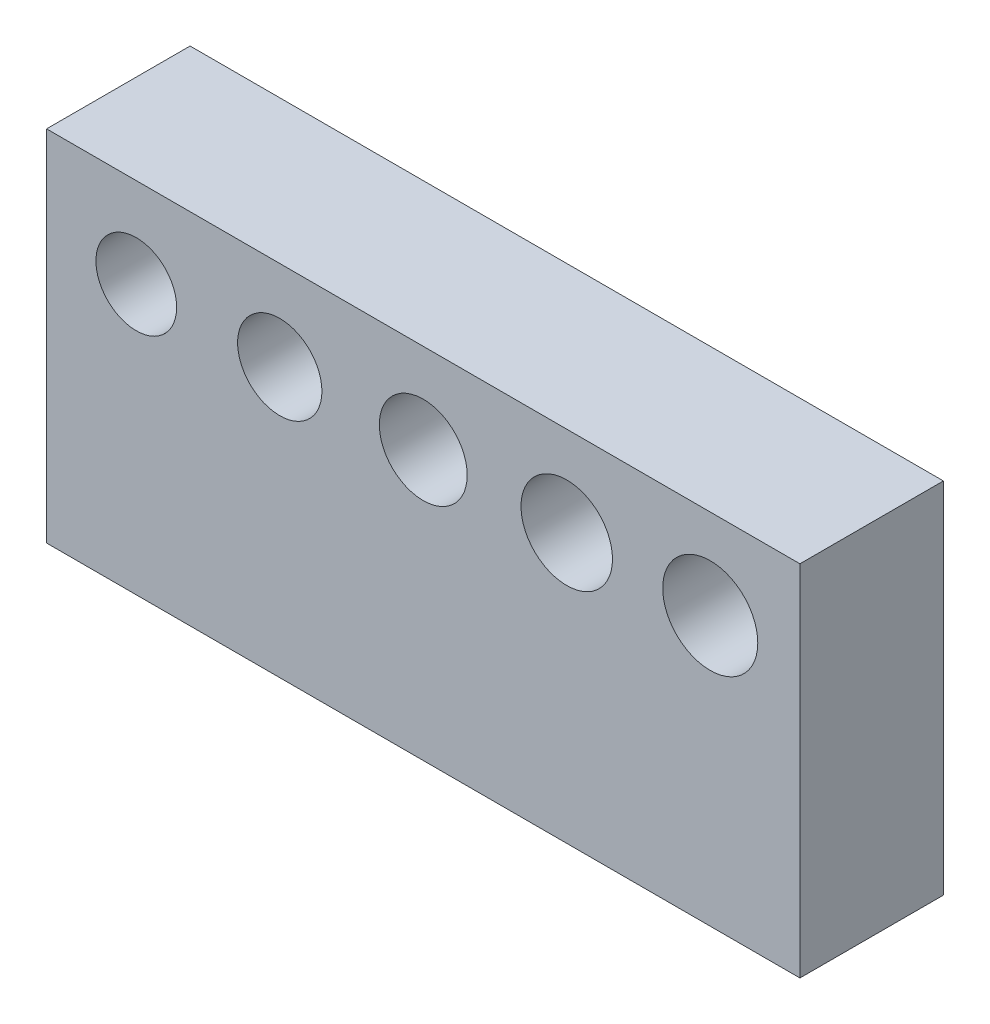
ISO-10303-21;
HEADER;
FILE_DESCRIPTION(('STEP AP214'),'2;1');
FILE_NAME('part.step','',(''),(''),'','','');
FILE_SCHEMA(('AUTOMOTIVE_DESIGN { 1 0 10303 214 1 1 1 1 }'));
ENDSEC;
DATA;
#1=APPLICATION_CONTEXT('core data for automotive mechanical design processes');
#2=APPLICATION_PROTOCOL_DEFINITION('international standard','automotive_design',2000,#1);
#3=PRODUCT_CONTEXT('',#1,'mechanical');
#4=PRODUCT('Part','Part','',(#3));
#5=PRODUCT_RELATED_PRODUCT_CATEGORY('part','',(#4));
#6=PRODUCT_DEFINITION_FORMATION('','',#4);
#7=PRODUCT_DEFINITION_CONTEXT('part definition',#1,'design');
#8=PRODUCT_DEFINITION('design','',#6,#7);
#9=PRODUCT_DEFINITION_SHAPE('','',#8);
#10=(LENGTH_UNIT() NAMED_UNIT(*) SI_UNIT(.MILLI.,.METRE.));
#11=(NAMED_UNIT(*) PLANE_ANGLE_UNIT() SI_UNIT($,.RADIAN.));
#12=(NAMED_UNIT(*) SI_UNIT($,.STERADIAN.) SOLID_ANGLE_UNIT());
#13=UNCERTAINTY_MEASURE_WITH_UNIT(LENGTH_MEASURE(1.E-05),#10,'distance_accuracy_value','');
#14=(GEOMETRIC_REPRESENTATION_CONTEXT(3) GLOBAL_UNCERTAINTY_ASSIGNED_CONTEXT((#13)) GLOBAL_UNIT_ASSIGNED_CONTEXT((#10,
#11,#12)) REPRESENTATION_CONTEXT('',''));
#15=CARTESIAN_POINT('',(0.,0.,0.));
#16=DIRECTION('',(0.,0.,1.));
#17=DIRECTION('',(1.,0.,0.));
#18=AXIS2_PLACEMENT_3D('',#15,#16,#17);
#19=CARTESIAN_POINT('',(21.,10.,8.));
#20=DIRECTION('',(-1.,0.,0.));
#21=DIRECTION('',(0.,0.,1.));
#22=AXIS2_PLACEMENT_3D('',#19,#20,#21);
#23=PLANE('',#22);
#24=DIRECTION('',(0.,1.,0.));
#25=VECTOR('',#24,1.);
#26=CARTESIAN_POINT('',(21.,10.,0.));
#27=LINE('',#26,#25);
#28=CARTESIAN_POINT('',(21.,-10.,0.));
#29=VERTEX_POINT('',#28);
#30=CARTESIAN_POINT('',(21.,10.,0.));
#31=VERTEX_POINT('',#30);
#32=EDGE_CURVE('E96',#29,#31,#27,.T.);
#33=ORIENTED_EDGE('',*,*,#32,.T.);
#34=DIRECTION('',(0.,0.,-1.));
#35=VECTOR('',#34,1.);
#36=CARTESIAN_POINT('',(21.,10.,8.));
#37=LINE('',#36,#35);
#38=CARTESIAN_POINT('',(21.,10.,8.));
#39=VERTEX_POINT('',#38);
#40=EDGE_CURVE('E11',#39,#31,#37,.T.);
#41=ORIENTED_EDGE('',*,*,#40,.F.);
#42=DIRECTION('',(0.,1.,0.));
#43=VECTOR('',#42,1.);
#44=CARTESIAN_POINT('',(21.,10.,8.));
#45=LINE('',#44,#43);
#46=CARTESIAN_POINT('',(21.,-10.,8.));
#47=VERTEX_POINT('',#46);
#48=EDGE_CURVE('E84',#47,#39,#45,.T.);
#49=ORIENTED_EDGE('',*,*,#48,.F.);
#50=DIRECTION('',(0.,0.,-1.));
#51=VECTOR('',#50,1.);
#52=CARTESIAN_POINT('',(21.,-10.,8.));
#53=LINE('',#52,#51);
#54=EDGE_CURVE('E92',#47,#29,#53,.T.);
#55=ORIENTED_EDGE('',*,*,#54,.T.);
#56=EDGE_LOOP('',(#33,#41,#49,#55));
#57=FACE_BOUND('',#56,.T.);
#58=ADVANCED_FACE('F33',(#57),#23,.F.);
#59=CARTESIAN_POINT('',(-21.,10.,8.));
#60=DIRECTION('',(0.,-1.,0.));
#61=DIRECTION('',(0.,0.,-1.));
#62=AXIS2_PLACEMENT_3D('',#59,#60,#61);
#63=PLANE('',#62);
#64=DIRECTION('',(-1.,0.,0.));
#65=VECTOR('',#64,1.);
#66=CARTESIAN_POINT('',(-21.,10.,0.));
#67=LINE('',#66,#65);
#68=CARTESIAN_POINT('',(-21.,10.,0.));
#69=VERTEX_POINT('',#68);
#70=EDGE_CURVE('E88',#31,#69,#67,.T.);
#71=ORIENTED_EDGE('',*,*,#70,.T.);
#72=DIRECTION('',(0.,0.,-1.));
#73=VECTOR('',#72,1.);
#74=CARTESIAN_POINT('',(-21.,10.,8.));
#75=LINE('',#74,#73);
#76=CARTESIAN_POINT('',(-21.,10.,8.));
#77=VERTEX_POINT('',#76);
#78=EDGE_CURVE('E41',#77,#69,#75,.T.);
#79=ORIENTED_EDGE('',*,*,#78,.F.);
#80=DIRECTION('',(-1.,0.,0.));
#81=VECTOR('',#80,1.);
#82=CARTESIAN_POINT('',(-21.,10.,8.));
#83=LINE('',#82,#81);
#84=EDGE_CURVE('E79',#39,#77,#83,.T.);
#85=ORIENTED_EDGE('',*,*,#84,.F.);
#86=ORIENTED_EDGE('',*,*,#40,.T.);
#87=EDGE_LOOP('',(#71,#79,#85,#86));
#88=FACE_BOUND('',#87,.T.);
#89=ADVANCED_FACE('F87',(#88),#63,.F.);
#90=CARTESIAN_POINT('',(-21.,10.,8.));
#91=DIRECTION('',(1.,0.,0.));
#92=DIRECTION('',(0.,0.,-1.));
#93=AXIS2_PLACEMENT_3D('',#90,#91,#92);
#94=PLANE('',#93);
#95=DIRECTION('',(0.,-1.,0.));
#96=VECTOR('',#95,1.);
#97=CARTESIAN_POINT('',(-21.,10.,0.));
#98=LINE('',#97,#96);
#99=CARTESIAN_POINT('',(-21.,-10.,0.));
#100=VERTEX_POINT('',#99);
#101=EDGE_CURVE('E66',#69,#100,#98,.T.);
#102=ORIENTED_EDGE('',*,*,#101,.T.);
#103=DIRECTION('',(0.,0.,-1.));
#104=VECTOR('',#103,1.);
#105=CARTESIAN_POINT('',(-21.,-10.,8.));
#106=LINE('',#105,#104);
#107=CARTESIAN_POINT('',(-21.,-10.,8.));
#108=VERTEX_POINT('',#107);
#109=EDGE_CURVE('E89',#108,#100,#106,.T.);
#110=ORIENTED_EDGE('',*,*,#109,.F.);
#111=DIRECTION('',(0.,-1.,0.));
#112=VECTOR('',#111,1.);
#113=CARTESIAN_POINT('',(-21.,10.,8.));
#114=LINE('',#113,#112);
#115=EDGE_CURVE('E82',#77,#108,#114,.T.);
#116=ORIENTED_EDGE('',*,*,#115,.F.);
#117=ORIENTED_EDGE('',*,*,#78,.T.);
#118=EDGE_LOOP('',(#102,#110,#116,#117));
#119=FACE_BOUND('',#118,.T.);
#120=ADVANCED_FACE('F90',(#119),#94,.F.);
#121=CARTESIAN_POINT('',(-21.,-10.,8.));
#122=DIRECTION('',(0.,1.,0.));
#123=DIRECTION('',(0.,0.,1.));
#124=AXIS2_PLACEMENT_3D('',#121,#122,#123);
#125=PLANE('',#124);
#126=CARTESIAN_POINT('',(-16.,-10.,4.));
#127=DIRECTION('',(0.,-1.,0.));
#128=DIRECTION('',(0.,0.,-1.));
#129=AXIS2_PLACEMENT_3D('',#126,#127,#128);
#130=CIRCLE('',#129,2.15);
#131=CARTESIAN_POINT('',(-16.,-10.,1.85));
#132=VERTEX_POINT('',#131);
#133=EDGE_CURVE('E158',#132,#132,#130,.T.);
#134=ORIENTED_EDGE('',*,*,#133,.F.);
#135=EDGE_LOOP('',(#134));
#136=FACE_BOUND('',#135,.T.);
#137=CARTESIAN_POINT('',(-7.99999999999999,-10.,4.));
#138=DIRECTION('',(0.,-1.,0.));
#139=DIRECTION('',(0.,0.,-1.));
#140=AXIS2_PLACEMENT_3D('',#137,#138,#139);
#141=CIRCLE('',#140,2.25);
#142=CARTESIAN_POINT('',(-7.99999999999999,-10.,1.75));
#143=VERTEX_POINT('',#142);
#144=EDGE_CURVE('E152',#143,#143,#141,.T.);
#145=ORIENTED_EDGE('',*,*,#144,.F.);
#146=EDGE_LOOP('',(#145));
#147=FACE_BOUND('',#146,.T.);
#148=CARTESIAN_POINT('',(0.,-10.,4.));
#149=DIRECTION('',(0.,-1.,0.));
#150=DIRECTION('',(0.,0.,-1.));
#151=AXIS2_PLACEMENT_3D('',#148,#149,#150);
#152=CIRCLE('',#151,2.35);
#153=CARTESIAN_POINT('',(0.,-10.,1.65));
#154=VERTEX_POINT('',#153);
#155=EDGE_CURVE('E146',#154,#154,#152,.T.);
#156=ORIENTED_EDGE('',*,*,#155,.F.);
#157=EDGE_LOOP('',(#156));
#158=FACE_BOUND('',#157,.T.);
#159=CARTESIAN_POINT('',(8.00000000000001,-10.,4.));
#160=DIRECTION('',(0.,-1.,0.));
#161=DIRECTION('',(0.,0.,-1.));
#162=AXIS2_PLACEMENT_3D('',#159,#160,#161);
#163=CIRCLE('',#162,2.45);
#164=CARTESIAN_POINT('',(8.00000000000001,-10.,1.55));
#165=VERTEX_POINT('',#164);
#166=EDGE_CURVE('E140',#165,#165,#163,.T.);
#167=ORIENTED_EDGE('',*,*,#166,.F.);
#168=EDGE_LOOP('',(#167));
#169=FACE_BOUND('',#168,.T.);
#170=DIRECTION('',(1.,0.,0.));
#171=VECTOR('',#170,1.);
#172=CARTESIAN_POINT('',(-21.,-10.,0.));
#173=LINE('',#172,#171);
#174=EDGE_CURVE('E72',#100,#29,#173,.T.);
#175=ORIENTED_EDGE('',*,*,#174,.T.);
#176=ORIENTED_EDGE('',*,*,#54,.F.);
#177=DIRECTION('',(1.,0.,0.));
#178=VECTOR('',#177,1.);
#179=CARTESIAN_POINT('',(-21.,-10.,8.));
#180=LINE('',#179,#178);
#181=EDGE_CURVE('E49',#108,#47,#180,.T.);
#182=ORIENTED_EDGE('',*,*,#181,.F.);
#183=ORIENTED_EDGE('',*,*,#109,.T.);
#184=EDGE_LOOP('',(#175,#176,#182,#183));
#185=FACE_BOUND('',#184,.T.);
#186=ADVANCED_FACE('F104',(#136,#147,#158,#169,#185),#125,.F.);
#187=CARTESIAN_POINT('',(0.,0.,8.));
#188=DIRECTION('',(0.,0.,1.));
#189=DIRECTION('',(1.,0.,0.));
#190=AXIS2_PLACEMENT_3D('',#187,#188,#189);
#191=PLANE('',#190);
#192=CARTESIAN_POINT('',(-16.,5.,8.));
#193=DIRECTION('',(0.,0.,1.));
#194=DIRECTION('',(1.,0.,0.));
#195=AXIS2_PLACEMENT_3D('',#192,#193,#194);
#196=CIRCLE('',#195,2.25);
#197=CARTESIAN_POINT('',(-13.75,5.,8.));
#198=VERTEX_POINT('',#197);
#199=EDGE_CURVE('E135',#198,#198,#196,.T.);
#200=ORIENTED_EDGE('',*,*,#199,.F.);
#201=EDGE_LOOP('',(#200));
#202=FACE_BOUND('',#201,.T.);
#203=CARTESIAN_POINT('',(-7.99999999999999,5.,8.));
#204=DIRECTION('',(0.,0.,1.));
#205=DIRECTION('',(1.,0.,0.));
#206=AXIS2_PLACEMENT_3D('',#203,#204,#205);
#207=CIRCLE('',#206,2.35);
#208=CARTESIAN_POINT('',(-5.64999999999999,5.,8.));
#209=VERTEX_POINT('',#208);
#210=EDGE_CURVE('E129',#209,#209,#207,.T.);
#211=ORIENTED_EDGE('',*,*,#210,.F.);
#212=EDGE_LOOP('',(#211));
#213=FACE_BOUND('',#212,.T.);
#214=CARTESIAN_POINT('',(0.,5.,8.));
#215=DIRECTION('',(0.,0.,1.));
#216=DIRECTION('',(1.,0.,0.));
#217=AXIS2_PLACEMENT_3D('',#214,#215,#216);
#218=CIRCLE('',#217,2.45);
#219=CARTESIAN_POINT('',(2.45000000000001,5.,8.));
#220=VERTEX_POINT('',#219);
#221=EDGE_CURVE('E123',#220,#220,#218,.T.);
#222=ORIENTED_EDGE('',*,*,#221,.F.);
#223=EDGE_LOOP('',(#222));
#224=FACE_BOUND('',#223,.T.);
#225=CARTESIAN_POINT('',(8.00000000000001,5.,8.));
#226=DIRECTION('',(0.,0.,1.));
#227=DIRECTION('',(1.,0.,0.));
#228=AXIS2_PLACEMENT_3D('',#225,#226,#227);
#229=CIRCLE('',#228,2.55);
#230=CARTESIAN_POINT('',(10.55,5.,8.));
#231=VERTEX_POINT('',#230);
#232=EDGE_CURVE('E117',#231,#231,#229,.T.);
#233=ORIENTED_EDGE('',*,*,#232,.F.);
#234=EDGE_LOOP('',(#233));
#235=FACE_BOUND('',#234,.T.);
#236=CARTESIAN_POINT('',(16.,5.,8.));
#237=DIRECTION('',(0.,0.,1.));
#238=DIRECTION('',(1.,0.,0.));
#239=AXIS2_PLACEMENT_3D('',#236,#237,#238);
#240=CIRCLE('',#239,2.65);
#241=CARTESIAN_POINT('',(18.65,5.,8.));
#242=VERTEX_POINT('',#241);
#243=EDGE_CURVE('E110',#242,#242,#240,.T.);
#244=ORIENTED_EDGE('',*,*,#243,.F.);
#245=EDGE_LOOP('',(#244));
#246=FACE_BOUND('',#245,.T.);
#247=ORIENTED_EDGE('',*,*,#48,.T.);
#248=ORIENTED_EDGE('',*,*,#84,.T.);
#249=ORIENTED_EDGE('',*,*,#115,.T.);
#250=ORIENTED_EDGE('',*,*,#181,.T.);
#251=EDGE_LOOP('',(#247,#248,#249,#250));
#252=FACE_BOUND('',#251,.T.);
#253=ADVANCED_FACE('F80',(#202,#213,#224,#235,#246,#252),#191,.T.);
#254=CARTESIAN_POINT('',(0.,0.,0.));
#255=DIRECTION('',(0.,0.,1.));
#256=DIRECTION('',(1.,0.,0.));
#257=AXIS2_PLACEMENT_3D('',#254,#255,#256);
#258=PLANE('',#257);
#259=CARTESIAN_POINT('',(-16.,5.,0.));
#260=DIRECTION('',(0.,0.,1.));
#261=DIRECTION('',(1.,0.,0.));
#262=AXIS2_PLACEMENT_3D('',#259,#260,#261);
#263=CIRCLE('',#262,2.25);
#264=CARTESIAN_POINT('',(-13.75,5.,0.));
#265=VERTEX_POINT('',#264);
#266=EDGE_CURVE('E99',#265,#265,#263,.T.);
#267=ORIENTED_EDGE('',*,*,#266,.T.);
#268=EDGE_LOOP('',(#267));
#269=FACE_BOUND('',#268,.T.);
#270=CARTESIAN_POINT('',(-7.99999999999999,5.,0.));
#271=DIRECTION('',(0.,0.,1.));
#272=DIRECTION('',(1.,0.,0.));
#273=AXIS2_PLACEMENT_3D('',#270,#271,#272);
#274=CIRCLE('',#273,2.35);
#275=CARTESIAN_POINT('',(-5.64999999999999,5.,0.));
#276=VERTEX_POINT('',#275);
#277=EDGE_CURVE('E132',#276,#276,#274,.T.);
#278=ORIENTED_EDGE('',*,*,#277,.T.);
#279=EDGE_LOOP('',(#278));
#280=FACE_BOUND('',#279,.T.);
#281=CARTESIAN_POINT('',(0.,5.,0.));
#282=DIRECTION('',(0.,0.,1.));
#283=DIRECTION('',(1.,0.,0.));
#284=AXIS2_PLACEMENT_3D('',#281,#282,#283);
#285=CIRCLE('',#284,2.45);
#286=CARTESIAN_POINT('',(2.45000000000001,5.,0.));
#287=VERTEX_POINT('',#286);
#288=EDGE_CURVE('E126',#287,#287,#285,.T.);
#289=ORIENTED_EDGE('',*,*,#288,.T.);
#290=EDGE_LOOP('',(#289));
#291=FACE_BOUND('',#290,.T.);
#292=CARTESIAN_POINT('',(8.00000000000001,5.,0.));
#293=DIRECTION('',(0.,0.,1.));
#294=DIRECTION('',(1.,0.,0.));
#295=AXIS2_PLACEMENT_3D('',#292,#293,#294);
#296=CIRCLE('',#295,2.55);
#297=CARTESIAN_POINT('',(10.55,5.,0.));
#298=VERTEX_POINT('',#297);
#299=EDGE_CURVE('E120',#298,#298,#296,.T.);
#300=ORIENTED_EDGE('',*,*,#299,.T.);
#301=EDGE_LOOP('',(#300));
#302=FACE_BOUND('',#301,.T.);
#303=CARTESIAN_POINT('',(16.,5.,0.));
#304=DIRECTION('',(0.,0.,1.));
#305=DIRECTION('',(1.,0.,0.));
#306=AXIS2_PLACEMENT_3D('',#303,#304,#305);
#307=CIRCLE('',#306,2.65);
#308=CARTESIAN_POINT('',(18.65,5.,0.));
#309=VERTEX_POINT('',#308);
#310=EDGE_CURVE('E113',#309,#309,#307,.T.);
#311=ORIENTED_EDGE('',*,*,#310,.T.);
#312=EDGE_LOOP('',(#311));
#313=FACE_BOUND('',#312,.T.);
#314=ORIENTED_EDGE('',*,*,#32,.F.);
#315=ORIENTED_EDGE('',*,*,#174,.F.);
#316=ORIENTED_EDGE('',*,*,#101,.F.);
#317=ORIENTED_EDGE('',*,*,#70,.F.);
#318=EDGE_LOOP('',(#314,#315,#316,#317));
#319=FACE_BOUND('',#318,.T.);
#320=ADVANCED_FACE('F107',(#269,#280,#291,#302,#313,#319),#258,.F.);
#321=CARTESIAN_POINT('',(16.,5.,0.));
#322=DIRECTION('',(0.,0.,1.));
#323=DIRECTION('',(1.,0.,0.));
#324=AXIS2_PLACEMENT_3D('',#321,#322,#323);
#325=CYLINDRICAL_SURFACE('',#324,2.65);
#326=ORIENTED_EDGE('',*,*,#310,.F.);
#327=EDGE_LOOP('',(#326));
#328=FACE_BOUND('',#327,.T.);
#329=ORIENTED_EDGE('',*,*,#243,.T.);
#330=EDGE_LOOP('',(#329));
#331=FACE_BOUND('',#330,.T.);
#332=ADVANCED_FACE('F210',(#328,#331),#325,.F.);
#333=CARTESIAN_POINT('',(8.00000000000001,5.,0.));
#334=DIRECTION('',(0.,0.,1.));
#335=DIRECTION('',(1.,0.,0.));
#336=AXIS2_PLACEMENT_3D('',#333,#334,#335);
#337=CYLINDRICAL_SURFACE('',#336,2.55);
#338=ORIENTED_EDGE('',*,*,#299,.F.);
#339=EDGE_LOOP('',(#338));
#340=FACE_BOUND('',#339,.T.);
#341=ORIENTED_EDGE('',*,*,#232,.T.);
#342=EDGE_LOOP('',(#341));
#343=FACE_BOUND('',#342,.T.);
#344=ADVANCED_FACE('F217',(#340,#343),#337,.F.);
#345=CARTESIAN_POINT('',(0.,5.,0.));
#346=DIRECTION('',(0.,0.,1.));
#347=DIRECTION('',(1.,0.,0.));
#348=AXIS2_PLACEMENT_3D('',#345,#346,#347);
#349=CYLINDRICAL_SURFACE('',#348,2.45);
#350=ORIENTED_EDGE('',*,*,#288,.F.);
#351=EDGE_LOOP('',(#350));
#352=FACE_BOUND('',#351,.T.);
#353=ORIENTED_EDGE('',*,*,#221,.T.);
#354=EDGE_LOOP('',(#353));
#355=FACE_BOUND('',#354,.T.);
#356=ADVANCED_FACE('F221',(#352,#355),#349,.F.);
#357=CARTESIAN_POINT('',(-7.99999999999999,5.,0.));
#358=DIRECTION('',(0.,0.,1.));
#359=DIRECTION('',(1.,0.,0.));
#360=AXIS2_PLACEMENT_3D('',#357,#358,#359);
#361=CYLINDRICAL_SURFACE('',#360,2.35);
#362=ORIENTED_EDGE('',*,*,#277,.F.);
#363=EDGE_LOOP('',(#362));
#364=FACE_BOUND('',#363,.T.);
#365=ORIENTED_EDGE('',*,*,#210,.T.);
#366=EDGE_LOOP('',(#365));
#367=FACE_BOUND('',#366,.T.);
#368=ADVANCED_FACE('F195',(#364,#367),#361,.F.);
#369=CARTESIAN_POINT('',(-16.,5.,0.));
#370=DIRECTION('',(0.,0.,1.));
#371=DIRECTION('',(1.,0.,0.));
#372=AXIS2_PLACEMENT_3D('',#369,#370,#371);
#373=CYLINDRICAL_SURFACE('',#372,2.25);
#374=ORIENTED_EDGE('',*,*,#266,.F.);
#375=EDGE_LOOP('',(#374));
#376=FACE_BOUND('',#375,.T.);
#377=ORIENTED_EDGE('',*,*,#199,.T.);
#378=EDGE_LOOP('',(#377));
#379=FACE_BOUND('',#378,.T.);
#380=ADVANCED_FACE('F185',(#376,#379),#373,.F.);
#381=CARTESIAN_POINT('',(8.00000000000001,0.,4.));
#382=DIRECTION('',(0.,-1.,0.));
#383=DIRECTION('',(0.,0.,-1.));
#384=AXIS2_PLACEMENT_3D('',#381,#382,#383);
#385=CYLINDRICAL_SURFACE('',#384,2.45);
#386=CARTESIAN_POINT('',(8.00000000000001,0.,4.));
#387=DIRECTION('',(0.,-1.,0.));
#388=DIRECTION('',(0.,0.,-1.));
#389=AXIS2_PLACEMENT_3D('',#386,#387,#388);
#390=CIRCLE('',#389,2.45);
#391=CARTESIAN_POINT('',(8.00000000000001,0.,1.55));
#392=VERTEX_POINT('',#391);
#393=EDGE_CURVE('E143',#392,#392,#390,.T.);
#394=ORIENTED_EDGE('',*,*,#393,.F.);
#395=EDGE_LOOP('',(#394));
#396=FACE_BOUND('',#395,.T.);
#397=ORIENTED_EDGE('',*,*,#166,.T.);
#398=EDGE_LOOP('',(#397));
#399=FACE_BOUND('',#398,.T.);
#400=ADVANCED_FACE('F182',(#396,#399),#385,.F.);
#401=CARTESIAN_POINT('',(8.00000000000001,0.,4.));
#402=DIRECTION('',(0.,-1.,0.));
#403=DIRECTION('',(0.,0.,-1.));
#404=AXIS2_PLACEMENT_3D('',#401,#402,#403);
#405=PLANE('',#404);
#406=ORIENTED_EDGE('',*,*,#393,.T.);
#407=EDGE_LOOP('',(#406));
#408=FACE_BOUND('',#407,.T.);
#409=ADVANCED_FACE('F184',(#408),#405,.T.);
#410=CARTESIAN_POINT('',(0.,0.,4.));
#411=DIRECTION('',(0.,-1.,0.));
#412=DIRECTION('',(0.,0.,-1.));
#413=AXIS2_PLACEMENT_3D('',#410,#411,#412);
#414=CYLINDRICAL_SURFACE('',#413,2.35);
#415=CARTESIAN_POINT('',(0.,0.,4.));
#416=DIRECTION('',(0.,-1.,0.));
#417=DIRECTION('',(0.,0.,-1.));
#418=AXIS2_PLACEMENT_3D('',#415,#416,#417);
#419=CIRCLE('',#418,2.35);
#420=CARTESIAN_POINT('',(0.,0.,1.65));
#421=VERTEX_POINT('',#420);
#422=EDGE_CURVE('E149',#421,#421,#419,.T.);
#423=ORIENTED_EDGE('',*,*,#422,.F.);
#424=EDGE_LOOP('',(#423));
#425=FACE_BOUND('',#424,.T.);
#426=ORIENTED_EDGE('',*,*,#155,.T.);
#427=EDGE_LOOP('',(#426));
#428=FACE_BOUND('',#427,.T.);
#429=ADVANCED_FACE('F192',(#425,#428),#414,.F.);
#430=CARTESIAN_POINT('',(0.,0.,4.));
#431=DIRECTION('',(0.,-1.,0.));
#432=DIRECTION('',(0.,0.,-1.));
#433=AXIS2_PLACEMENT_3D('',#430,#431,#432);
#434=PLANE('',#433);
#435=ORIENTED_EDGE('',*,*,#422,.T.);
#436=EDGE_LOOP('',(#435));
#437=FACE_BOUND('',#436,.T.);
#438=ADVANCED_FACE('F283',(#437),#434,.T.);
#439=CARTESIAN_POINT('',(-7.99999999999999,0.,4.));
#440=DIRECTION('',(0.,-1.,0.));
#441=DIRECTION('',(0.,0.,-1.));
#442=AXIS2_PLACEMENT_3D('',#439,#440,#441);
#443=CYLINDRICAL_SURFACE('',#442,2.25);
#444=CARTESIAN_POINT('',(-7.99999999999999,0.,4.));
#445=DIRECTION('',(0.,-1.,0.));
#446=DIRECTION('',(0.,0.,-1.));
#447=AXIS2_PLACEMENT_3D('',#444,#445,#446);
#448=CIRCLE('',#447,2.25);
#449=CARTESIAN_POINT('',(-7.99999999999999,0.,1.75));
#450=VERTEX_POINT('',#449);
#451=EDGE_CURVE('E155',#450,#450,#448,.T.);
#452=ORIENTED_EDGE('',*,*,#451,.F.);
#453=EDGE_LOOP('',(#452));
#454=FACE_BOUND('',#453,.T.);
#455=ORIENTED_EDGE('',*,*,#144,.T.);
#456=EDGE_LOOP('',(#455));
#457=FACE_BOUND('',#456,.T.);
#458=ADVANCED_FACE('F293',(#454,#457),#443,.F.);
#459=CARTESIAN_POINT('',(-7.99999999999999,0.,4.));
#460=DIRECTION('',(0.,-1.,0.));
#461=DIRECTION('',(0.,0.,-1.));
#462=AXIS2_PLACEMENT_3D('',#459,#460,#461);
#463=PLANE('',#462);
#464=ORIENTED_EDGE('',*,*,#451,.T.);
#465=EDGE_LOOP('',(#464));
#466=FACE_BOUND('',#465,.T.);
#467=ADVANCED_FACE('F169',(#466),#463,.T.);
#468=CARTESIAN_POINT('',(-16.,0.,4.));
#469=DIRECTION('',(0.,-1.,0.));
#470=DIRECTION('',(0.,0.,-1.));
#471=AXIS2_PLACEMENT_3D('',#468,#469,#470);
#472=CYLINDRICAL_SURFACE('',#471,2.15);
#473=CARTESIAN_POINT('',(-16.,0.,4.));
#474=DIRECTION('',(0.,-1.,0.));
#475=DIRECTION('',(0.,0.,-1.));
#476=AXIS2_PLACEMENT_3D('',#473,#474,#475);
#477=CIRCLE('',#476,2.15);
#478=CARTESIAN_POINT('',(-16.,0.,1.85));
#479=VERTEX_POINT('',#478);
#480=EDGE_CURVE('E114',#479,#479,#477,.T.);
#481=ORIENTED_EDGE('',*,*,#480,.F.);
#482=EDGE_LOOP('',(#481));
#483=FACE_BOUND('',#482,.T.);
#484=ORIENTED_EDGE('',*,*,#133,.T.);
#485=EDGE_LOOP('',(#484));
#486=FACE_BOUND('',#485,.T.);
#487=ADVANCED_FACE('F166',(#483,#486),#472,.F.);
#488=CARTESIAN_POINT('',(-16.,0.,4.));
#489=DIRECTION('',(0.,-1.,0.));
#490=DIRECTION('',(0.,0.,-1.));
#491=AXIS2_PLACEMENT_3D('',#488,#489,#490);
#492=PLANE('',#491);
#493=ORIENTED_EDGE('',*,*,#480,.T.);
#494=EDGE_LOOP('',(#493));
#495=FACE_BOUND('',#494,.T.);
#496=ADVANCED_FACE('F164',(#495),#492,.T.);
#497=CLOSED_SHELL('',(#58,#89,#120,#186,#253,#320,#332,#344,#356,#368,#380,#400,#409,#429,#438,
#458,#467,#487,#496));
#498=MANIFOLD_SOLID_BREP('B2',#497);
#499=ADVANCED_BREP_SHAPE_REPRESENTATION('',(#18,#498),#14);
#500=SHAPE_DEFINITION_REPRESENTATION(#9,#499);
ENDSEC;
END-ISO-10303-21;
